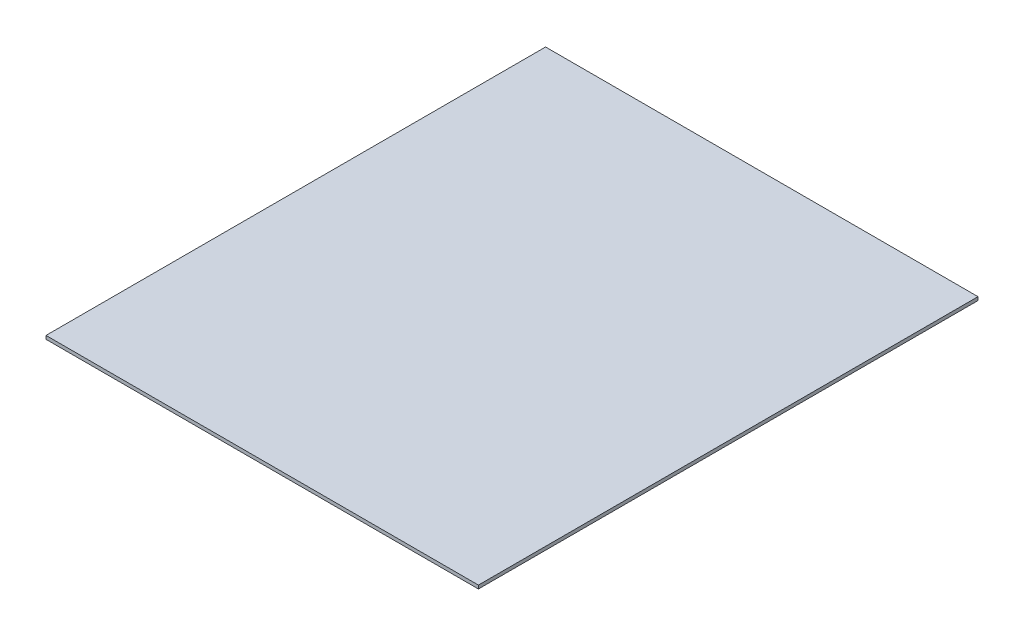
ISO-10303-21;
HEADER;
FILE_DESCRIPTION(('STEP AP214'),'2;1');
FILE_NAME('part.step','',(''),(''),'','','');
FILE_SCHEMA(('AUTOMOTIVE_DESIGN { 1 0 10303 214 1 1 1 1 }'));
ENDSEC;
DATA;
#1=APPLICATION_CONTEXT('core data for automotive mechanical design processes');
#2=APPLICATION_PROTOCOL_DEFINITION('international standard','automotive_design',2000,#1);
#3=PRODUCT_CONTEXT('',#1,'mechanical');
#4=PRODUCT('Part','Part','',(#3));
#5=PRODUCT_RELATED_PRODUCT_CATEGORY('part','',(#4));
#6=PRODUCT_DEFINITION_FORMATION('','',#4);
#7=PRODUCT_DEFINITION_CONTEXT('part definition',#1,'design');
#8=PRODUCT_DEFINITION('design','',#6,#7);
#9=PRODUCT_DEFINITION_SHAPE('','',#8);
#10=(LENGTH_UNIT() NAMED_UNIT(*) SI_UNIT(.MILLI.,.METRE.));
#11=(NAMED_UNIT(*) PLANE_ANGLE_UNIT() SI_UNIT($,.RADIAN.));
#12=(NAMED_UNIT(*) SI_UNIT($,.STERADIAN.) SOLID_ANGLE_UNIT());
#13=UNCERTAINTY_MEASURE_WITH_UNIT(LENGTH_MEASURE(1.E-05),#10,'distance_accuracy_value','');
#14=(GEOMETRIC_REPRESENTATION_CONTEXT(3) GLOBAL_UNCERTAINTY_ASSIGNED_CONTEXT((#13)) GLOBAL_UNIT_ASSIGNED_CONTEXT((#10,
#11,#12)) REPRESENTATION_CONTEXT('',''));
#15=CARTESIAN_POINT('',(0.,0.,0.));
#16=DIRECTION('',(0.,0.,1.));
#17=DIRECTION('',(1.,0.,0.));
#18=AXIS2_PLACEMENT_3D('',#15,#16,#17);
#19=CARTESIAN_POINT('',(190.,3.,219.5));
#20=DIRECTION('',(-1.,0.,0.));
#21=DIRECTION('',(0.,0.,1.));
#22=AXIS2_PLACEMENT_3D('',#19,#20,#21);
#23=PLANE('',#22);
#24=DIRECTION('',(0.,0.,-1.));
#25=VECTOR('',#24,1.);
#26=CARTESIAN_POINT('',(190.,0.,219.5));
#27=LINE('',#26,#25);
#28=CARTESIAN_POINT('',(190.,0.,219.5));
#29=VERTEX_POINT('',#28);
#30=CARTESIAN_POINT('',(190.,0.,-219.5));
#31=VERTEX_POINT('',#30);
#32=EDGE_CURVE('E99',#29,#31,#27,.T.);
#33=ORIENTED_EDGE('',*,*,#32,.T.);
#34=DIRECTION('',(0.,-1.,0.));
#35=VECTOR('',#34,1.);
#36=CARTESIAN_POINT('',(190.,3.,-219.5));
#37=LINE('',#36,#35);
#38=CARTESIAN_POINT('',(190.,3.,-219.5));
#39=VERTEX_POINT('',#38);
#40=EDGE_CURVE('E11',#39,#31,#37,.T.);
#41=ORIENTED_EDGE('',*,*,#40,.F.);
#42=DIRECTION('',(0.,0.,-1.));
#43=VECTOR('',#42,1.);
#44=CARTESIAN_POINT('',(190.,3.,219.5));
#45=LINE('',#44,#43);
#46=CARTESIAN_POINT('',(190.,3.,219.5));
#47=VERTEX_POINT('',#46);
#48=EDGE_CURVE('E87',#47,#39,#45,.T.);
#49=ORIENTED_EDGE('',*,*,#48,.F.);
#50=DIRECTION('',(0.,-1.,0.));
#51=VECTOR('',#50,1.);
#52=CARTESIAN_POINT('',(190.,3.,219.5));
#53=LINE('',#52,#51);
#54=EDGE_CURVE('E95',#47,#29,#53,.T.);
#55=ORIENTED_EDGE('',*,*,#54,.T.);
#56=EDGE_LOOP('',(#33,#41,#49,#55));
#57=FACE_BOUND('',#56,.T.);
#58=ADVANCED_FACE('F36',(#57),#23,.F.);
#59=CARTESIAN_POINT('',(-190.,3.,-219.5));
#60=DIRECTION('',(0.,0.,1.));
#61=DIRECTION('',(1.,0.,0.));
#62=AXIS2_PLACEMENT_3D('',#59,#60,#61);
#63=PLANE('',#62);
#64=DIRECTION('',(-1.,0.,0.));
#65=VECTOR('',#64,1.);
#66=CARTESIAN_POINT('',(-190.,0.,-219.5));
#67=LINE('',#66,#65);
#68=CARTESIAN_POINT('',(-190.,0.,-219.5));
#69=VERTEX_POINT('',#68);
#70=EDGE_CURVE('E91',#31,#69,#67,.T.);
#71=ORIENTED_EDGE('',*,*,#70,.T.);
#72=DIRECTION('',(0.,-1.,0.));
#73=VECTOR('',#72,1.);
#74=CARTESIAN_POINT('',(-190.,3.,-219.5));
#75=LINE('',#74,#73);
#76=CARTESIAN_POINT('',(-190.,3.,-219.5));
#77=VERTEX_POINT('',#76);
#78=EDGE_CURVE('E44',#77,#69,#75,.T.);
#79=ORIENTED_EDGE('',*,*,#78,.F.);
#80=DIRECTION('',(-1.,0.,0.));
#81=VECTOR('',#80,1.);
#82=CARTESIAN_POINT('',(-190.,3.,-219.5));
#83=LINE('',#82,#81);
#84=EDGE_CURVE('E82',#39,#77,#83,.T.);
#85=ORIENTED_EDGE('',*,*,#84,.F.);
#86=ORIENTED_EDGE('',*,*,#40,.T.);
#87=EDGE_LOOP('',(#71,#79,#85,#86));
#88=FACE_BOUND('',#87,.T.);
#89=ADVANCED_FACE('F90',(#88),#63,.F.);
#90=CARTESIAN_POINT('',(-190.,3.,219.5));
#91=DIRECTION('',(1.,0.,0.));
#92=DIRECTION('',(0.,0.,-1.));
#93=AXIS2_PLACEMENT_3D('',#90,#91,#92);
#94=PLANE('',#93);
#95=DIRECTION('',(0.,0.,1.));
#96=VECTOR('',#95,1.);
#97=CARTESIAN_POINT('',(-190.,0.,219.5));
#98=LINE('',#97,#96);
#99=CARTESIAN_POINT('',(-190.,0.,219.5));
#100=VERTEX_POINT('',#99);
#101=EDGE_CURVE('E69',#69,#100,#98,.T.);
#102=ORIENTED_EDGE('',*,*,#101,.T.);
#103=DIRECTION('',(0.,-1.,0.));
#104=VECTOR('',#103,1.);
#105=CARTESIAN_POINT('',(-190.,3.,219.5));
#106=LINE('',#105,#104);
#107=CARTESIAN_POINT('',(-190.,3.,219.5));
#108=VERTEX_POINT('',#107);
#109=EDGE_CURVE('E92',#108,#100,#106,.T.);
#110=ORIENTED_EDGE('',*,*,#109,.F.);
#111=DIRECTION('',(0.,0.,1.));
#112=VECTOR('',#111,1.);
#113=CARTESIAN_POINT('',(-190.,3.,219.5));
#114=LINE('',#113,#112);
#115=EDGE_CURVE('E85',#77,#108,#114,.T.);
#116=ORIENTED_EDGE('',*,*,#115,.F.);
#117=ORIENTED_EDGE('',*,*,#78,.T.);
#118=EDGE_LOOP('',(#102,#110,#116,#117));
#119=FACE_BOUND('',#118,.T.);
#120=ADVANCED_FACE('F93',(#119),#94,.F.);
#121=CARTESIAN_POINT('',(-190.,3.,219.5));
#122=DIRECTION('',(0.,0.,-1.));
#123=DIRECTION('',(-1.,0.,0.));
#124=AXIS2_PLACEMENT_3D('',#121,#122,#123);
#125=PLANE('',#124);
#126=DIRECTION('',(1.,0.,0.));
#127=VECTOR('',#126,1.);
#128=CARTESIAN_POINT('',(-190.,0.,219.5));
#129=LINE('',#128,#127);
#130=EDGE_CURVE('E75',#100,#29,#129,.T.);
#131=ORIENTED_EDGE('',*,*,#130,.T.);
#132=ORIENTED_EDGE('',*,*,#54,.F.);
#133=DIRECTION('',(1.,0.,0.));
#134=VECTOR('',#133,1.);
#135=CARTESIAN_POINT('',(-190.,3.,219.5));
#136=LINE('',#135,#134);
#137=EDGE_CURVE('E52',#108,#47,#136,.T.);
#138=ORIENTED_EDGE('',*,*,#137,.F.);
#139=ORIENTED_EDGE('',*,*,#109,.T.);
#140=EDGE_LOOP('',(#131,#132,#138,#139));
#141=FACE_BOUND('',#140,.T.);
#142=ADVANCED_FACE('F106',(#141),#125,.F.);
#143=CARTESIAN_POINT('',(0.,3.,0.));
#144=DIRECTION('',(0.,-1.,0.));
#145=DIRECTION('',(0.,0.,-1.));
#146=AXIS2_PLACEMENT_3D('',#143,#144,#145);
#147=PLANE('',#146);
#148=ORIENTED_EDGE('',*,*,#48,.T.);
#149=ORIENTED_EDGE('',*,*,#84,.T.);
#150=ORIENTED_EDGE('',*,*,#115,.T.);
#151=ORIENTED_EDGE('',*,*,#137,.T.);
#152=EDGE_LOOP('',(#148,#149,#150,#151));
#153=FACE_BOUND('',#152,.T.);
#154=ADVANCED_FACE('F83',(#153),#147,.F.);
#155=CARTESIAN_POINT('',(0.,0.,0.));
#156=DIRECTION('',(0.,-1.,0.));
#157=DIRECTION('',(0.,0.,-1.));
#158=AXIS2_PLACEMENT_3D('',#155,#156,#157);
#159=PLANE('',#158);
#160=ORIENTED_EDGE('',*,*,#32,.F.);
#161=ORIENTED_EDGE('',*,*,#130,.F.);
#162=ORIENTED_EDGE('',*,*,#101,.F.);
#163=ORIENTED_EDGE('',*,*,#70,.F.);
#164=EDGE_LOOP('',(#160,#161,#162,#163));
#165=FACE_BOUND('',#164,.T.);
#166=ADVANCED_FACE('F109',(#165),#159,.T.);
#167=CLOSED_SHELL('',(#58,#89,#120,#142,#154,#166));
#168=MANIFOLD_SOLID_BREP('B2',#167);
#169=ADVANCED_BREP_SHAPE_REPRESENTATION('',(#18,#168),#14);
#170=SHAPE_DEFINITION_REPRESENTATION(#9,#169);
ENDSEC;
END-ISO-10303-21;
